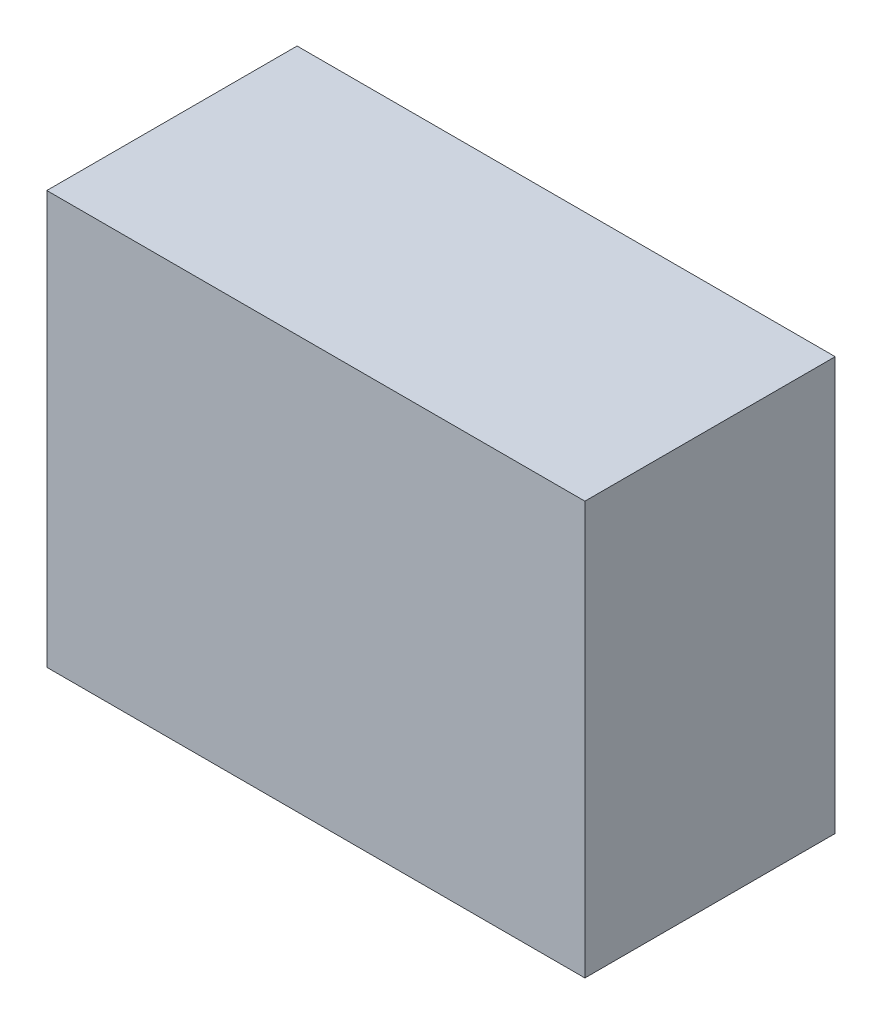
ISO-10303-21;
HEADER;
FILE_DESCRIPTION(('STEP AP214'),'2;1');
FILE_NAME('part.step','',(''),(''),'','','');
FILE_SCHEMA(('AUTOMOTIVE_DESIGN { 1 0 10303 214 1 1 1 1 }'));
ENDSEC;
DATA;
#1=APPLICATION_CONTEXT('core data for automotive mechanical design processes');
#2=APPLICATION_PROTOCOL_DEFINITION('international standard','automotive_design',2000,#1);
#3=PRODUCT_CONTEXT('',#1,'mechanical');
#4=PRODUCT('Part','Part','',(#3));
#5=PRODUCT_RELATED_PRODUCT_CATEGORY('part','',(#4));
#6=PRODUCT_DEFINITION_FORMATION('','',#4);
#7=PRODUCT_DEFINITION_CONTEXT('part definition',#1,'design');
#8=PRODUCT_DEFINITION('design','',#6,#7);
#9=PRODUCT_DEFINITION_SHAPE('','',#8);
#10=(LENGTH_UNIT() NAMED_UNIT(*) SI_UNIT(.MILLI.,.METRE.));
#11=(NAMED_UNIT(*) PLANE_ANGLE_UNIT() SI_UNIT($,.RADIAN.));
#12=(NAMED_UNIT(*) SI_UNIT($,.STERADIAN.) SOLID_ANGLE_UNIT());
#13=UNCERTAINTY_MEASURE_WITH_UNIT(LENGTH_MEASURE(1.E-05),#10,'distance_accuracy_value','');
#14=(GEOMETRIC_REPRESENTATION_CONTEXT(3) GLOBAL_UNCERTAINTY_ASSIGNED_CONTEXT((#13)) GLOBAL_UNIT_ASSIGNED_CONTEXT((#10,
#11,#12)) REPRESENTATION_CONTEXT('',''));
#15=CARTESIAN_POINT('',(0.,0.,0.));
#16=DIRECTION('',(0.,0.,1.));
#17=DIRECTION('',(1.,0.,0.));
#18=AXIS2_PLACEMENT_3D('',#15,#16,#17);
#19=CARTESIAN_POINT('',(1.07500166,-0.82499962,1.00000054));
#20=DIRECTION('',(0.,0.,1.));
#21=DIRECTION('',(1.,0.,0.));
#22=AXIS2_PLACEMENT_3D('',#19,#20,#21);
#23=PLANE('',#22);
#24=DIRECTION('',(0.,1.,0.));
#25=VECTOR('',#24,1.);
#26=CARTESIAN_POINT('',(-1.07499912,-0.82499962,1.00000054));
#27=LINE('',#26,#25);
#28=CARTESIAN_POINT('',(-1.07499912,-0.82499962,1.00000054));
#29=VERTEX_POINT('',#28);
#30=CARTESIAN_POINT('',(-1.07499912,0.82499962,1.00000054));
#31=VERTEX_POINT('',#30);
#32=EDGE_CURVE('E53',#29,#31,#27,.T.);
#33=ORIENTED_EDGE('',*,*,#32,.F.);
#34=DIRECTION('',(1.,0.,0.));
#35=VECTOR('',#34,1.);
#36=CARTESIAN_POINT('',(1.07500166,-0.82499962,1.00000054));
#37=LINE('',#36,#35);
#38=CARTESIAN_POINT('',(1.07500166,-0.82499962,1.00000054));
#39=VERTEX_POINT('',#38);
#40=EDGE_CURVE('E68',#39,#29,#37,.F.);
#41=ORIENTED_EDGE('',*,*,#40,.F.);
#42=DIRECTION('',(0.,1.,0.));
#43=VECTOR('',#42,1.);
#44=CARTESIAN_POINT('',(1.07500166,0.82499962,1.00000054));
#45=LINE('',#44,#43);
#46=CARTESIAN_POINT('',(1.07500166,0.82499962,1.00000054));
#47=VERTEX_POINT('',#46);
#48=EDGE_CURVE('E20',#47,#39,#45,.F.);
#49=ORIENTED_EDGE('',*,*,#48,.F.);
#50=DIRECTION('',(1.,0.,0.));
#51=VECTOR('',#50,1.);
#52=CARTESIAN_POINT('',(-1.07499912,0.82499962,1.00000054));
#53=LINE('',#52,#51);
#54=EDGE_CURVE('E58',#31,#47,#53,.T.);
#55=ORIENTED_EDGE('',*,*,#54,.F.);
#56=EDGE_LOOP('',(#33,#41,#49,#55));
#57=FACE_BOUND('',#56,.T.);
#58=ADVANCED_FACE('F17',(#57),#23,.T.);
#59=CARTESIAN_POINT('',(1.07500166,0.82499962,0.));
#60=DIRECTION('',(1.,0.,0.));
#61=DIRECTION('',(0.,0.,-1.));
#62=AXIS2_PLACEMENT_3D('',#59,#60,#61);
#63=PLANE('',#62);
#64=DIRECTION('',(0.,0.,-1.));
#65=VECTOR('',#64,1.);
#66=CARTESIAN_POINT('',(1.07500166,-0.82499962,0.));
#67=LINE('',#66,#65);
#68=CARTESIAN_POINT('',(1.07500166,-0.82499962,0.));
#69=VERTEX_POINT('',#68);
#70=EDGE_CURVE('E79',#69,#39,#67,.F.);
#71=ORIENTED_EDGE('',*,*,#70,.F.);
#72=DIRECTION('',(0.,1.,0.));
#73=VECTOR('',#72,1.);
#74=CARTESIAN_POINT('',(1.07500166,-0.82499962,0.));
#75=LINE('',#74,#73);
#76=CARTESIAN_POINT('',(1.07500166,0.82499962,0.));
#77=VERTEX_POINT('',#76);
#78=EDGE_CURVE('E74',#69,#77,#75,.T.);
#79=ORIENTED_EDGE('',*,*,#78,.T.);
#80=DIRECTION('',(0.,0.,1.));
#81=VECTOR('',#80,1.);
#82=CARTESIAN_POINT('',(1.07500166,0.82499962,0.));
#83=LINE('',#82,#81);
#84=EDGE_CURVE('E63',#47,#77,#83,.F.);
#85=ORIENTED_EDGE('',*,*,#84,.F.);
#86=ORIENTED_EDGE('',*,*,#48,.T.);
#87=EDGE_LOOP('',(#71,#79,#85,#86));
#88=FACE_BOUND('',#87,.T.);
#89=ADVANCED_FACE('F73',(#88),#63,.T.);
#90=CARTESIAN_POINT('',(-1.07499912,0.82499962,0.));
#91=DIRECTION('',(0.,1.,0.));
#92=DIRECTION('',(0.,0.,1.));
#93=AXIS2_PLACEMENT_3D('',#90,#91,#92);
#94=PLANE('',#93);
#95=ORIENTED_EDGE('',*,*,#84,.T.);
#96=DIRECTION('',(1.,0.,0.));
#97=VECTOR('',#96,1.);
#98=CARTESIAN_POINT('',(1.07500166,0.82499962,0.));
#99=LINE('',#98,#97);
#100=CARTESIAN_POINT('',(-1.07499912,0.82499962,0.));
#101=VERTEX_POINT('',#100);
#102=EDGE_CURVE('E84',#77,#101,#99,.F.);
#103=ORIENTED_EDGE('',*,*,#102,.T.);
#104=DIRECTION('',(0.,0.,1.));
#105=VECTOR('',#104,1.);
#106=CARTESIAN_POINT('',(-1.07499912,0.82499962,0.));
#107=LINE('',#106,#105);
#108=EDGE_CURVE('E65',#31,#101,#107,.F.);
#109=ORIENTED_EDGE('',*,*,#108,.F.);
#110=ORIENTED_EDGE('',*,*,#54,.T.);
#111=EDGE_LOOP('',(#95,#103,#109,#110));
#112=FACE_BOUND('',#111,.T.);
#113=ADVANCED_FACE('F60',(#112),#94,.T.);
#114=CARTESIAN_POINT('',(-1.07499912,-0.82499962,0.));
#115=DIRECTION('',(-1.,0.,0.));
#116=DIRECTION('',(0.,0.,1.));
#117=AXIS2_PLACEMENT_3D('',#114,#115,#116);
#118=PLANE('',#117);
#119=ORIENTED_EDGE('',*,*,#108,.T.);
#120=DIRECTION('',(0.,1.,0.));
#121=VECTOR('',#120,1.);
#122=CARTESIAN_POINT('',(-1.07499912,-0.82499962,0.));
#123=LINE('',#122,#121);
#124=CARTESIAN_POINT('',(-1.07499912,-0.82499962,0.));
#125=VERTEX_POINT('',#124);
#126=EDGE_CURVE('E26',#101,#125,#123,.F.);
#127=ORIENTED_EDGE('',*,*,#126,.T.);
#128=DIRECTION('',(0.,0.,-1.));
#129=VECTOR('',#128,1.);
#130=CARTESIAN_POINT('',(-1.07499912,-0.82499962,0.));
#131=LINE('',#130,#129);
#132=EDGE_CURVE('E34',#29,#125,#131,.T.);
#133=ORIENTED_EDGE('',*,*,#132,.F.);
#134=ORIENTED_EDGE('',*,*,#32,.T.);
#135=EDGE_LOOP('',(#119,#127,#133,#134));
#136=FACE_BOUND('',#135,.T.);
#137=ADVANCED_FACE('F88',(#136),#118,.T.);
#138=CARTESIAN_POINT('',(1.07500166,-0.82499962,0.));
#139=DIRECTION('',(0.,-1.,0.));
#140=DIRECTION('',(0.,0.,-1.));
#141=AXIS2_PLACEMENT_3D('',#138,#139,#140);
#142=PLANE('',#141);
#143=ORIENTED_EDGE('',*,*,#132,.T.);
#144=DIRECTION('',(1.,0.,0.));
#145=VECTOR('',#144,1.);
#146=CARTESIAN_POINT('',(1.07500166,-0.82499962,0.));
#147=LINE('',#146,#145);
#148=EDGE_CURVE('E11',#125,#69,#147,.T.);
#149=ORIENTED_EDGE('',*,*,#148,.T.);
#150=ORIENTED_EDGE('',*,*,#70,.T.);
#151=ORIENTED_EDGE('',*,*,#40,.T.);
#152=EDGE_LOOP('',(#143,#149,#150,#151));
#153=FACE_BOUND('',#152,.T.);
#154=ADVANCED_FACE('F91',(#153),#142,.T.);
#155=CARTESIAN_POINT('',(1.07500166,-0.82499962,0.));
#156=DIRECTION('',(0.,0.,1.));
#157=DIRECTION('',(1.,0.,0.));
#158=AXIS2_PLACEMENT_3D('',#155,#156,#157);
#159=PLANE('',#158);
#160=ORIENTED_EDGE('',*,*,#126,.F.);
#161=ORIENTED_EDGE('',*,*,#102,.F.);
#162=ORIENTED_EDGE('',*,*,#78,.F.);
#163=ORIENTED_EDGE('',*,*,#148,.F.);
#164=EDGE_LOOP('',(#160,#161,#162,#163));
#165=FACE_BOUND('',#164,.T.);
#166=ADVANCED_FACE('F90',(#165),#159,.F.);
#167=CLOSED_SHELL('',(#58,#89,#113,#137,#154,#166));
#168=MANIFOLD_SOLID_BREP('B1',#167);
#169=ADVANCED_BREP_SHAPE_REPRESENTATION('',(#18,#168),#14);
#170=SHAPE_DEFINITION_REPRESENTATION(#9,#169);
ENDSEC;
END-ISO-10303-21;
